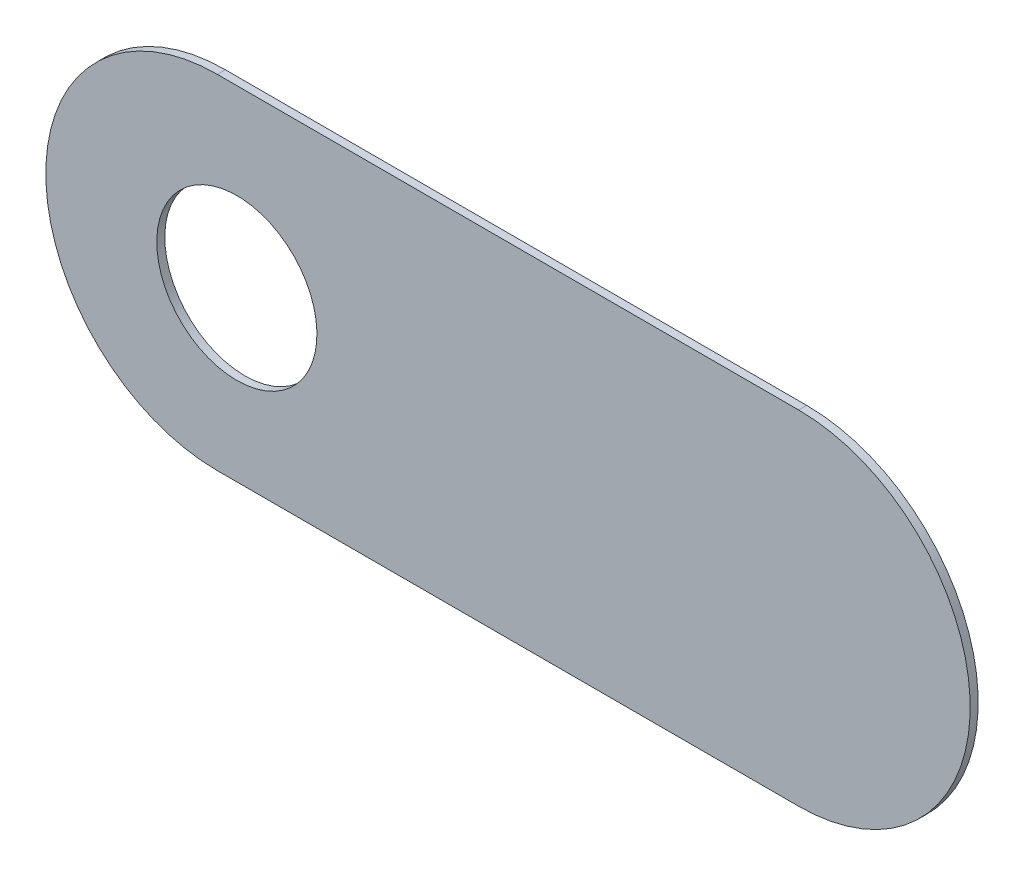
ISO-10303-21;
HEADER;
FILE_DESCRIPTION(('STEP AP214'),'2;1');
FILE_NAME('part.step','',(''),(''),'','','');
FILE_SCHEMA(('AUTOMOTIVE_DESIGN { 1 0 10303 214 1 1 1 1 }'));
ENDSEC;
DATA;
#1=APPLICATION_CONTEXT('core data for automotive mechanical design processes');
#2=APPLICATION_PROTOCOL_DEFINITION('international standard','automotive_design',2000,#1);
#3=PRODUCT_CONTEXT('',#1,'mechanical');
#4=PRODUCT('Part','Part','',(#3));
#5=PRODUCT_RELATED_PRODUCT_CATEGORY('part','',(#4));
#6=PRODUCT_DEFINITION_FORMATION('','',#4);
#7=PRODUCT_DEFINITION_CONTEXT('part definition',#1,'design');
#8=PRODUCT_DEFINITION('design','',#6,#7);
#9=PRODUCT_DEFINITION_SHAPE('','',#8);
#10=(LENGTH_UNIT() NAMED_UNIT(*) SI_UNIT(.MILLI.,.METRE.));
#11=(NAMED_UNIT(*) PLANE_ANGLE_UNIT() SI_UNIT($,.RADIAN.));
#12=(NAMED_UNIT(*) SI_UNIT($,.STERADIAN.) SOLID_ANGLE_UNIT());
#13=UNCERTAINTY_MEASURE_WITH_UNIT(LENGTH_MEASURE(1.E-05),#10,'distance_accuracy_value','');
#14=(GEOMETRIC_REPRESENTATION_CONTEXT(3) GLOBAL_UNCERTAINTY_ASSIGNED_CONTEXT((#13)) GLOBAL_UNIT_ASSIGNED_CONTEXT((#10,
#11,#12)) REPRESENTATION_CONTEXT('',''));
#15=CARTESIAN_POINT('',(0.,0.,0.));
#16=DIRECTION('',(0.,0.,1.));
#17=DIRECTION('',(1.,0.,0.));
#18=AXIS2_PLACEMENT_3D('',#15,#16,#17);
#19=CARTESIAN_POINT('',(115.401,-113.808,-0.045));
#20=DIRECTION('',(0.,0.,-1.));
#21=DIRECTION('',(0.,-1.,0.));
#22=AXIS2_PLACEMENT_3D('',#19,#20,#21);
#23=CYLINDRICAL_SURFACE('',#22,0.35);
#24=CARTESIAN_POINT('',(115.401,-113.808,-0.035));
#25=DIRECTION('',(0.,0.,-1.));
#26=DIRECTION('',(0.,-1.,0.));
#27=AXIS2_PLACEMENT_3D('',#24,#25,#26);
#28=CIRCLE('',#27,0.35);
#29=CARTESIAN_POINT('',(115.401,-114.158,-0.035));
#30=VERTEX_POINT('',#29);
#31=EDGE_CURVE('E121',#30,#30,#28,.T.);
#32=ORIENTED_EDGE('',*,*,#31,.T.);
#33=DIRECTION('',(0.,0.,1.));
#34=VECTOR('',#33,1.);
#35=CARTESIAN_POINT('',(115.401,-114.158,-0.045));
#36=LINE('',#35,#34);
#37=CARTESIAN_POINT('',(115.401,-114.158,0.));
#38=VERTEX_POINT('',#37);
#39=EDGE_CURVE('E11',#30,#38,#36,.T.);
#40=ORIENTED_EDGE('',*,*,#39,.T.);
#41=CARTESIAN_POINT('',(115.401,-113.808,0.));
#42=DIRECTION('',(0.,0.,-1.));
#43=DIRECTION('',(0.,-1.,0.));
#44=AXIS2_PLACEMENT_3D('',#41,#42,#43);
#45=CIRCLE('',#44,0.35);
#46=EDGE_CURVE('E20',#38,#38,#45,.T.);
#47=ORIENTED_EDGE('',*,*,#46,.F.);
#48=ORIENTED_EDGE('',*,*,#39,.F.);
#49=EDGE_LOOP('',(#32,#40,#47,#48));
#50=FACE_BOUND('',#49,.T.);
#51=ADVANCED_FACE('F17',(#50),#23,.F.);
#52=CARTESIAN_POINT('',(115.316,-114.542,-0.035));
#53=DIRECTION('',(0.,1.,0.));
#54=DIRECTION('',(1.,0.,0.));
#55=AXIS2_PLACEMENT_3D('',#52,#53,#54);
#56=PLANE('',#55);
#57=DIRECTION('',(1.,0.,0.));
#58=VECTOR('',#57,1.);
#59=CARTESIAN_POINT('',(115.316,-114.542,-0.035));
#60=LINE('',#59,#58);
#61=CARTESIAN_POINT('',(115.316,-114.542,-0.035));
#62=VERTEX_POINT('',#61);
#63=CARTESIAN_POINT('',(117.856,-114.542,-0.035));
#64=VERTEX_POINT('',#63);
#65=EDGE_CURVE('E129',#62,#64,#60,.T.);
#66=ORIENTED_EDGE('',*,*,#65,.T.);
#67=DIRECTION('',(0.,0.,1.));
#68=VECTOR('',#67,1.);
#69=CARTESIAN_POINT('',(117.856,-114.542,-0.035));
#70=LINE('',#69,#68);
#71=CARTESIAN_POINT('',(117.856,-114.542,0.));
#72=VERTEX_POINT('',#71);
#73=EDGE_CURVE('E87',#64,#72,#70,.T.);
#74=ORIENTED_EDGE('',*,*,#73,.T.);
#75=DIRECTION('',(1.,0.,0.));
#76=VECTOR('',#75,1.);
#77=CARTESIAN_POINT('',(115.316,-114.542,0.));
#78=LINE('',#77,#76);
#79=CARTESIAN_POINT('',(115.316,-114.542,0.));
#80=VERTEX_POINT('',#79);
#81=EDGE_CURVE('E82',#80,#72,#78,.T.);
#82=ORIENTED_EDGE('',*,*,#81,.F.);
#83=DIRECTION('',(0.,0.,1.));
#84=VECTOR('',#83,1.);
#85=CARTESIAN_POINT('',(115.316,-114.542,-0.035));
#86=LINE('',#85,#84);
#87=EDGE_CURVE('E111',#62,#80,#86,.T.);
#88=ORIENTED_EDGE('',*,*,#87,.F.);
#89=EDGE_LOOP('',(#66,#74,#82,#88));
#90=FACE_BOUND('',#89,.T.);
#91=ADVANCED_FACE('F191',(#90),#56,.F.);
#92=CARTESIAN_POINT('',(117.856,-113.042,0.));
#93=DIRECTION('',(0.,0.,1.));
#94=DIRECTION('',(1.,0.,0.));
#95=AXIS2_PLACEMENT_3D('',#92,#93,#94);
#96=PLANE('',#95);
#97=ORIENTED_EDGE('',*,*,#46,.T.);
#98=EDGE_LOOP('',(#97));
#99=FACE_BOUND('',#98,.T.);
#100=DIRECTION('',(-1.,0.,0.));
#101=VECTOR('',#100,1.);
#102=CARTESIAN_POINT('',(117.856,-113.042,0.));
#103=LINE('',#102,#101);
#104=CARTESIAN_POINT('',(117.856,-113.042,0.));
#105=VERTEX_POINT('',#104);
#106=CARTESIAN_POINT('',(115.316,-113.042,0.));
#107=VERTEX_POINT('',#106);
#108=EDGE_CURVE('E80',#105,#107,#103,.T.);
#109=ORIENTED_EDGE('',*,*,#108,.T.);
#110=CARTESIAN_POINT('',(115.316,-113.792,0.));
#111=DIRECTION('',(0.,0.,1.));
#112=DIRECTION('',(0.,1.,0.));
#113=AXIS2_PLACEMENT_3D('',#110,#111,#112);
#114=CIRCLE('',#113,0.75);
#115=EDGE_CURVE('E115',#107,#80,#114,.T.);
#116=ORIENTED_EDGE('',*,*,#115,.T.);
#117=ORIENTED_EDGE('',*,*,#81,.T.);
#118=CARTESIAN_POINT('',(117.856,-113.792,0.));
#119=DIRECTION('',(0.,0.,1.));
#120=DIRECTION('',(0.,-1.,0.));
#121=AXIS2_PLACEMENT_3D('',#118,#119,#120);
#122=CIRCLE('',#121,0.75);
#123=EDGE_CURVE('E75',#72,#105,#122,.T.);
#124=ORIENTED_EDGE('',*,*,#123,.T.);
#125=EDGE_LOOP('',(#109,#116,#117,#124));
#126=FACE_BOUND('',#125,.T.);
#127=ADVANCED_FACE('F77',(#99,#126),#96,.T.);
#128=CARTESIAN_POINT('',(117.856,-113.042,-0.035));
#129=DIRECTION('',(0.,0.,1.));
#130=DIRECTION('',(1.,0.,0.));
#131=AXIS2_PLACEMENT_3D('',#128,#129,#130);
#132=PLANE('',#131);
#133=ORIENTED_EDGE('',*,*,#31,.F.);
#134=EDGE_LOOP('',(#133));
#135=FACE_BOUND('',#134,.T.);
#136=CARTESIAN_POINT('',(117.856,-113.792,-0.035));
#137=DIRECTION('',(0.,0.,1.));
#138=DIRECTION('',(0.,-1.,0.));
#139=AXIS2_PLACEMENT_3D('',#136,#137,#138);
#140=CIRCLE('',#139,0.75);
#141=CARTESIAN_POINT('',(117.856,-113.042,-0.035));
#142=VERTEX_POINT('',#141);
#143=EDGE_CURVE('E88',#64,#142,#140,.T.);
#144=ORIENTED_EDGE('',*,*,#143,.F.);
#145=ORIENTED_EDGE('',*,*,#65,.F.);
#146=CARTESIAN_POINT('',(115.316,-113.792,-0.035));
#147=DIRECTION('',(0.,0.,1.));
#148=DIRECTION('',(0.,1.,0.));
#149=AXIS2_PLACEMENT_3D('',#146,#147,#148);
#150=CIRCLE('',#149,0.75);
#151=CARTESIAN_POINT('',(115.316,-113.042,-0.035));
#152=VERTEX_POINT('',#151);
#153=EDGE_CURVE('E116',#152,#62,#150,.T.);
#154=ORIENTED_EDGE('',*,*,#153,.F.);
#155=DIRECTION('',(-1.,0.,0.));
#156=VECTOR('',#155,1.);
#157=CARTESIAN_POINT('',(117.856,-113.042,-0.035));
#158=LINE('',#157,#156);
#159=EDGE_CURVE('E108',#142,#152,#158,.T.);
#160=ORIENTED_EDGE('',*,*,#159,.F.);
#161=EDGE_LOOP('',(#144,#145,#154,#160));
#162=FACE_BOUND('',#161,.T.);
#163=ADVANCED_FACE('F137',(#135,#162),#132,.F.);
#164=CARTESIAN_POINT('',(115.316,-113.792,-0.035));
#165=DIRECTION('',(0.,0.,-1.));
#166=DIRECTION('',(0.,1.,0.));
#167=AXIS2_PLACEMENT_3D('',#164,#165,#166);
#168=CYLINDRICAL_SURFACE('',#167,0.75);
#169=ORIENTED_EDGE('',*,*,#153,.T.);
#170=ORIENTED_EDGE('',*,*,#87,.T.);
#171=ORIENTED_EDGE('',*,*,#115,.F.);
#172=DIRECTION('',(0.,0.,1.));
#173=VECTOR('',#172,1.);
#174=CARTESIAN_POINT('',(115.316,-113.042,-0.035));
#175=LINE('',#174,#173);
#176=EDGE_CURVE('E101',#152,#107,#175,.T.);
#177=ORIENTED_EDGE('',*,*,#176,.F.);
#178=EDGE_LOOP('',(#169,#170,#171,#177));
#179=FACE_BOUND('',#178,.T.);
#180=ADVANCED_FACE('F140',(#179),#168,.T.);
#181=CARTESIAN_POINT('',(117.856,-113.792,-0.035));
#182=DIRECTION('',(0.,0.,-1.));
#183=DIRECTION('',(0.,-1.,0.));
#184=AXIS2_PLACEMENT_3D('',#181,#182,#183);
#185=CYLINDRICAL_SURFACE('',#184,0.75);
#186=ORIENTED_EDGE('',*,*,#143,.T.);
#187=DIRECTION('',(0.,0.,1.));
#188=VECTOR('',#187,1.);
#189=CARTESIAN_POINT('',(117.856,-113.042,-0.035));
#190=LINE('',#189,#188);
#191=EDGE_CURVE('E91',#142,#105,#190,.T.);
#192=ORIENTED_EDGE('',*,*,#191,.T.);
#193=ORIENTED_EDGE('',*,*,#123,.F.);
#194=ORIENTED_EDGE('',*,*,#73,.F.);
#195=EDGE_LOOP('',(#186,#192,#193,#194));
#196=FACE_BOUND('',#195,.T.);
#197=ADVANCED_FACE('F92',(#196),#185,.T.);
#198=CARTESIAN_POINT('',(117.856,-113.042,-0.035));
#199=DIRECTION('',(0.,-1.,0.));
#200=DIRECTION('',(0.,0.,-1.));
#201=AXIS2_PLACEMENT_3D('',#198,#199,#200);
#202=PLANE('',#201);
#203=ORIENTED_EDGE('',*,*,#159,.T.);
#204=ORIENTED_EDGE('',*,*,#176,.T.);
#205=ORIENTED_EDGE('',*,*,#108,.F.);
#206=ORIENTED_EDGE('',*,*,#191,.F.);
#207=EDGE_LOOP('',(#203,#204,#205,#206));
#208=FACE_BOUND('',#207,.T.);
#209=ADVANCED_FACE('F99',(#208),#202,.F.);
#210=CLOSED_SHELL('',(#51,#91,#127,#163,#180,#197,#209));
#211=MANIFOLD_SOLID_BREP('B1',#210);
#212=ADVANCED_BREP_SHAPE_REPRESENTATION('',(#18,#211),#14);
#213=SHAPE_DEFINITION_REPRESENTATION(#9,#212);
ENDSEC;
END-ISO-10303-21;
